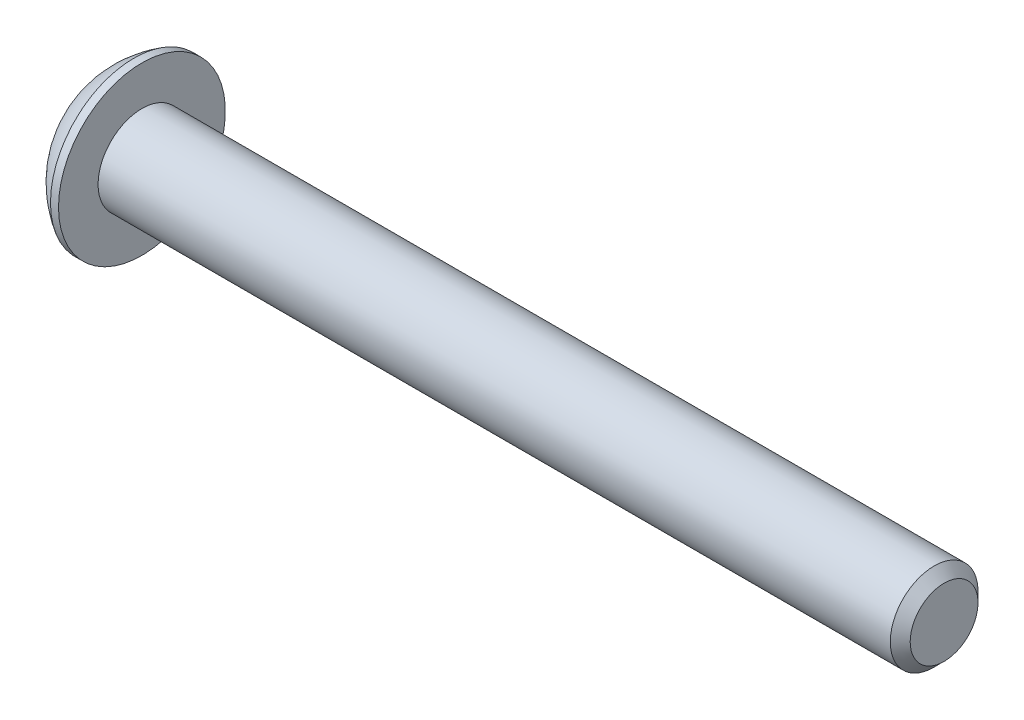
ISO-10303-21;
HEADER;
FILE_DESCRIPTION(('STEP AP214'),'2;1');
FILE_NAME('part.step','',(''),(''),'','','');
FILE_SCHEMA(('AUTOMOTIVE_DESIGN { 1 0 10303 214 1 1 1 1 }'));
ENDSEC;
DATA;
#1=APPLICATION_CONTEXT('core data for automotive mechanical design processes');
#2=APPLICATION_PROTOCOL_DEFINITION('international standard','automotive_design',2000,#1);
#3=PRODUCT_CONTEXT('',#1,'mechanical');
#4=PRODUCT('Part','Part','',(#3));
#5=PRODUCT_RELATED_PRODUCT_CATEGORY('part','',(#4));
#6=PRODUCT_DEFINITION_FORMATION('','',#4);
#7=PRODUCT_DEFINITION_CONTEXT('part definition',#1,'design');
#8=PRODUCT_DEFINITION('design','',#6,#7);
#9=PRODUCT_DEFINITION_SHAPE('','',#8);
#10=(LENGTH_UNIT() NAMED_UNIT(*) SI_UNIT(.MILLI.,.METRE.));
#11=(NAMED_UNIT(*) PLANE_ANGLE_UNIT() SI_UNIT($,.RADIAN.));
#12=(NAMED_UNIT(*) SI_UNIT($,.STERADIAN.) SOLID_ANGLE_UNIT());
#13=UNCERTAINTY_MEASURE_WITH_UNIT(LENGTH_MEASURE(1.E-05),#10,'distance_accuracy_value','');
#14=(GEOMETRIC_REPRESENTATION_CONTEXT(3) GLOBAL_UNCERTAINTY_ASSIGNED_CONTEXT((#13)) GLOBAL_UNIT_ASSIGNED_CONTEXT((#10,
#11,#12)) REPRESENTATION_CONTEXT('',''));
#15=CARTESIAN_POINT('',(0.,0.,0.));
#16=DIRECTION('',(0.,0.,1.));
#17=DIRECTION('',(1.,0.,0.));
#18=AXIS2_PLACEMENT_3D('',#15,#16,#17);
#19=CARTESIAN_POINT('',(1.32080000000034,0.,0.));
#20=DIRECTION('',(-1.,0.,0.));
#21=DIRECTION('',(0.,0.,1.));
#22=AXIS2_PLACEMENT_3D('',#19,#20,#21);
#23=CONICAL_SURFACE('',#22,1.1937999999998,1.04719755119608);
#24=CARTESIAN_POINT('',(2.01004075135902,0.,4.44089209850063E-13));
#25=VERTEX_POINT('',#24);
#26=VERTEX_LOOP('',#25);
#27=FACE_BOUND('',#26,.T.);
#28=CARTESIAN_POINT('',(1.32080000000009,0.,0.));
#29=DIRECTION('',(-1.,0.,0.));
#30=DIRECTION('',(0.,0.,1.));
#31=AXIS2_PLACEMENT_3D('',#28,#29,#30);
#32=CIRCLE('',#31,1.19380000000024);
#33=CARTESIAN_POINT('',(1.32080000000004,-1.03386112703797,0.59690000000006));
#34=VERTEX_POINT('',#33);
#35=CARTESIAN_POINT('',(1.32080000000004,0.,1.19380000000012));
#36=VERTEX_POINT('',#35);
#37=EDGE_CURVE('E19',#34,#36,#32,.T.);
#38=ORIENTED_EDGE('',*,*,#37,.T.);
#39=CARTESIAN_POINT('',(1.32080000000009,0.,0.));
#40=DIRECTION('',(-1.,0.,0.));
#41=DIRECTION('',(0.,0.,1.));
#42=AXIS2_PLACEMENT_3D('',#39,#40,#41);
#43=CIRCLE('',#42,1.19380000000024);
#44=CARTESIAN_POINT('',(1.32080000000004,1.03386112703797,0.596900000000061));
#45=VERTEX_POINT('',#44);
#46=EDGE_CURVE('E147',#36,#45,#43,.T.);
#47=ORIENTED_EDGE('',*,*,#46,.T.);
#48=CARTESIAN_POINT('',(1.32080000000009,0.,0.));
#49=DIRECTION('',(-1.,0.,0.));
#50=DIRECTION('',(0.,0.,1.));
#51=AXIS2_PLACEMENT_3D('',#48,#49,#50);
#52=CIRCLE('',#51,1.19380000000024);
#53=CARTESIAN_POINT('',(1.32080000000004,1.03386112703797,-0.596900000000061));
#54=VERTEX_POINT('',#53);
#55=EDGE_CURVE('E402',#45,#54,#52,.T.);
#56=ORIENTED_EDGE('',*,*,#55,.T.);
#57=CARTESIAN_POINT('',(1.32080000000009,0.,0.));
#58=DIRECTION('',(-1.,0.,0.));
#59=DIRECTION('',(0.,0.,1.));
#60=AXIS2_PLACEMENT_3D('',#57,#58,#59);
#61=CIRCLE('',#60,1.19380000000024);
#62=CARTESIAN_POINT('',(1.32080000000004,1.49457637585666E-12,-1.19380000000012));
#63=VERTEX_POINT('',#62);
#64=EDGE_CURVE('E403',#54,#63,#61,.T.);
#65=ORIENTED_EDGE('',*,*,#64,.T.);
#66=CARTESIAN_POINT('',(1.32080000000009,0.,0.));
#67=DIRECTION('',(-1.,0.,0.));
#68=DIRECTION('',(0.,0.,1.));
#69=AXIS2_PLACEMENT_3D('',#66,#67,#68);
#70=CIRCLE('',#69,1.19380000000024);
#71=CARTESIAN_POINT('',(1.32080000000004,-1.03386112703797,-0.59690000000006));
#72=VERTEX_POINT('',#71);
#73=EDGE_CURVE('E92',#63,#72,#70,.T.);
#74=ORIENTED_EDGE('',*,*,#73,.T.);
#75=CARTESIAN_POINT('',(1.32080000000009,0.,0.));
#76=DIRECTION('',(-1.,0.,0.));
#77=DIRECTION('',(0.,0.,1.));
#78=AXIS2_PLACEMENT_3D('',#75,#76,#77);
#79=CIRCLE('',#78,1.19380000000024);
#80=EDGE_CURVE('E88',#72,#34,#79,.T.);
#81=ORIENTED_EDGE('',*,*,#80,.T.);
#82=EDGE_LOOP('',(#38,#47,#56,#65,#74,#81));
#83=FACE_BOUND('',#82,.T.);
#84=ADVANCED_FACE('F16',(#27,#83),#23,.F.);
#85=CARTESIAN_POINT('',(1.3208,-2.06772225407572,-1.1938));
#86=DIRECTION('',(1.,0.,0.));
#87=DIRECTION('',(0.,0.,-1.));
#88=AXIS2_PLACEMENT_3D('',#85,#86,#87);
#89=PLANE('',#88);
#90=DIRECTION('',(0.,0.5,0.866025403784439));
#91=VECTOR('',#90,1.);
#92=CARTESIAN_POINT('',(1.3208,-1.37848150271715,0.));
#93=LINE('',#92,#91);
#94=CARTESIAN_POINT('',(1.3208,-0.689240751358574,1.1938));
#95=VERTEX_POINT('',#94);
#96=EDGE_CURVE('E100',#95,#34,#93,.F.);
#97=ORIENTED_EDGE('',*,*,#96,.F.);
#98=DIRECTION('',(0.,1.,0.));
#99=VECTOR('',#98,1.);
#100=CARTESIAN_POINT('',(1.3208,-0.689240751358574,1.1938));
#101=LINE('',#100,#99);
#102=EDGE_CURVE('E102',#36,#95,#101,.F.);
#103=ORIENTED_EDGE('',*,*,#102,.F.);
#104=ORIENTED_EDGE('',*,*,#37,.F.);
#105=EDGE_LOOP('',(#97,#103,#104));
#106=FACE_BOUND('',#105,.T.);
#107=ADVANCED_FACE('F98',(#106),#89,.F.);
#108=CARTESIAN_POINT('',(1.3208,-2.06772225407572,-1.1938));
#109=DIRECTION('',(1.,0.,0.));
#110=DIRECTION('',(0.,0.,-1.));
#111=AXIS2_PLACEMENT_3D('',#108,#109,#110);
#112=PLANE('',#111);
#113=DIRECTION('',(0.,-0.5,0.866025403784439));
#114=VECTOR('',#113,1.);
#115=CARTESIAN_POINT('',(1.3208,-0.689240751358574,-1.1938));
#116=LINE('',#115,#114);
#117=CARTESIAN_POINT('',(1.3208,-1.37848150271715,0.));
#118=VERTEX_POINT('',#117);
#119=EDGE_CURVE('E108',#118,#72,#116,.F.);
#120=ORIENTED_EDGE('',*,*,#119,.F.);
#121=DIRECTION('',(0.,0.5,0.866025403784439));
#122=VECTOR('',#121,1.);
#123=CARTESIAN_POINT('',(1.3208,-1.37848150271715,0.));
#124=LINE('',#123,#122);
#125=EDGE_CURVE('E105',#34,#118,#124,.F.);
#126=ORIENTED_EDGE('',*,*,#125,.F.);
#127=ORIENTED_EDGE('',*,*,#80,.F.);
#128=EDGE_LOOP('',(#120,#126,#127));
#129=FACE_BOUND('',#128,.T.);
#130=ADVANCED_FACE('F106',(#129),#112,.F.);
#131=CARTESIAN_POINT('',(1.3208,-2.06772225407572,-1.1938));
#132=DIRECTION('',(1.,0.,0.));
#133=DIRECTION('',(0.,0.,-1.));
#134=AXIS2_PLACEMENT_3D('',#131,#132,#133);
#135=PLANE('',#134);
#136=DIRECTION('',(0.,1.,0.));
#137=VECTOR('',#136,1.);
#138=CARTESIAN_POINT('',(1.3208,0.689240751358577,-1.1938));
#139=LINE('',#138,#137);
#140=CARTESIAN_POINT('',(1.3208,-0.689240751358574,-1.1938));
#141=VERTEX_POINT('',#140);
#142=EDGE_CURVE('E373',#141,#63,#139,.T.);
#143=ORIENTED_EDGE('',*,*,#142,.F.);
#144=DIRECTION('',(0.,-0.5,0.866025403784439));
#145=VECTOR('',#144,1.);
#146=CARTESIAN_POINT('',(1.3208,-0.689240751358574,-1.1938));
#147=LINE('',#146,#145);
#148=EDGE_CURVE('E385',#72,#141,#147,.F.);
#149=ORIENTED_EDGE('',*,*,#148,.F.);
#150=ORIENTED_EDGE('',*,*,#73,.F.);
#151=EDGE_LOOP('',(#143,#149,#150));
#152=FACE_BOUND('',#151,.T.);
#153=ADVANCED_FACE('F190',(#152),#135,.F.);
#154=CARTESIAN_POINT('',(1.3208,-2.06772225407572,-1.1938));
#155=DIRECTION('',(1.,0.,0.));
#156=DIRECTION('',(0.,0.,-1.));
#157=AXIS2_PLACEMENT_3D('',#154,#155,#156);
#158=PLANE('',#157);
#159=DIRECTION('',(0.,-0.5,-0.866025403784439));
#160=VECTOR('',#159,1.);
#161=CARTESIAN_POINT('',(1.3208,1.37848150271715,0.));
#162=LINE('',#161,#160);
#163=CARTESIAN_POINT('',(1.3208,0.689240751358577,-1.1938));
#164=VERTEX_POINT('',#163);
#165=EDGE_CURVE('E359',#164,#54,#162,.F.);
#166=ORIENTED_EDGE('',*,*,#165,.F.);
#167=DIRECTION('',(0.,1.,0.));
#168=VECTOR('',#167,1.);
#169=CARTESIAN_POINT('',(1.3208,0.689240751358577,-1.1938));
#170=LINE('',#169,#168);
#171=EDGE_CURVE('E370',#63,#164,#170,.T.);
#172=ORIENTED_EDGE('',*,*,#171,.F.);
#173=ORIENTED_EDGE('',*,*,#64,.F.);
#174=EDGE_LOOP('',(#166,#172,#173));
#175=FACE_BOUND('',#174,.T.);
#176=ADVANCED_FACE('F186',(#175),#158,.F.);
#177=CARTESIAN_POINT('',(1.3208,-2.06772225407572,-1.1938));
#178=DIRECTION('',(1.,0.,0.));
#179=DIRECTION('',(0.,0.,-1.));
#180=AXIS2_PLACEMENT_3D('',#177,#178,#179);
#181=PLANE('',#180);
#182=DIRECTION('',(0.,0.5,-0.866025403784439));
#183=VECTOR('',#182,1.);
#184=CARTESIAN_POINT('',(1.3208,0.689240751358576,1.1938));
#185=LINE('',#184,#183);
#186=CARTESIAN_POINT('',(1.3208,1.37848150271715,0.));
#187=VERTEX_POINT('',#186);
#188=EDGE_CURVE('E338',#187,#45,#185,.F.);
#189=ORIENTED_EDGE('',*,*,#188,.F.);
#190=DIRECTION('',(0.,-0.5,-0.866025403784439));
#191=VECTOR('',#190,1.);
#192=CARTESIAN_POINT('',(1.3208,1.37848150271715,0.));
#193=LINE('',#192,#191);
#194=EDGE_CURVE('E357',#54,#187,#193,.F.);
#195=ORIENTED_EDGE('',*,*,#194,.F.);
#196=ORIENTED_EDGE('',*,*,#55,.F.);
#197=EDGE_LOOP('',(#189,#195,#196));
#198=FACE_BOUND('',#197,.T.);
#199=ADVANCED_FACE('F182',(#198),#181,.F.);
#200=CARTESIAN_POINT('',(1.3208,-2.06772225407572,-1.1938));
#201=DIRECTION('',(1.,0.,0.));
#202=DIRECTION('',(0.,0.,-1.));
#203=AXIS2_PLACEMENT_3D('',#200,#201,#202);
#204=PLANE('',#203);
#205=DIRECTION('',(0.,1.,0.));
#206=VECTOR('',#205,1.);
#207=CARTESIAN_POINT('',(1.3208,-0.689240751358574,1.1938));
#208=LINE('',#207,#206);
#209=CARTESIAN_POINT('',(1.3208,0.689240751358576,1.1938));
#210=VERTEX_POINT('',#209);
#211=EDGE_CURVE('E117',#210,#36,#208,.F.);
#212=ORIENTED_EDGE('',*,*,#211,.F.);
#213=DIRECTION('',(0.,0.5,-0.866025403784439));
#214=VECTOR('',#213,1.);
#215=CARTESIAN_POINT('',(1.3208,0.689240751358576,1.1938));
#216=LINE('',#215,#214);
#217=EDGE_CURVE('E341',#45,#210,#216,.F.);
#218=ORIENTED_EDGE('',*,*,#217,.F.);
#219=ORIENTED_EDGE('',*,*,#46,.F.);
#220=EDGE_LOOP('',(#212,#218,#219));
#221=FACE_BOUND('',#220,.T.);
#222=ADVANCED_FACE('F178',(#221),#204,.F.);
#223=CARTESIAN_POINT('',(1.3208,-0.689240751358574,1.1938));
#224=DIRECTION('',(0.,0.,-1.));
#225=DIRECTION('',(0.,1.,0.));
#226=AXIS2_PLACEMENT_3D('',#223,#224,#225);
#227=PLANE('',#226);
#228=DIRECTION('',(0.,1.,0.));
#229=VECTOR('',#228,1.);
#230=CARTESIAN_POINT('',(0.,0.,1.1938));
#231=LINE('',#230,#229);
#232=CARTESIAN_POINT('',(0.,0.689240751358577,1.1938));
#233=VERTEX_POINT('',#232);
#234=CARTESIAN_POINT('',(0.,-0.689240751358574,1.1938));
#235=VERTEX_POINT('',#234);
#236=EDGE_CURVE('E335',#233,#235,#231,.F.);
#237=ORIENTED_EDGE('',*,*,#236,.F.);
#238=DIRECTION('',(1.,0.,0.));
#239=VECTOR('',#238,1.);
#240=CARTESIAN_POINT('',(1.3208,0.689240751358576,1.1938));
#241=LINE('',#240,#239);
#242=EDGE_CURVE('E347',#210,#233,#241,.F.);
#243=ORIENTED_EDGE('',*,*,#242,.F.);
#244=ORIENTED_EDGE('',*,*,#211,.T.);
#245=ORIENTED_EDGE('',*,*,#102,.T.);
#246=DIRECTION('',(1.,0.,0.));
#247=VECTOR('',#246,1.);
#248=CARTESIAN_POINT('',(1.3208,-0.689240751358574,1.1938));
#249=LINE('',#248,#247);
#250=EDGE_CURVE('E111',#235,#95,#249,.T.);
#251=ORIENTED_EDGE('',*,*,#250,.F.);
#252=EDGE_LOOP('',(#237,#243,#244,#245,#251));
#253=FACE_BOUND('',#252,.T.);
#254=ADVANCED_FACE('F175',(#253),#227,.T.);
#255=CARTESIAN_POINT('',(1.3208,-1.37848150271715,0.));
#256=DIRECTION('',(0.,0.866025403784439,-0.5));
#257=DIRECTION('',(0.,0.5,0.866025403784439));
#258=AXIS2_PLACEMENT_3D('',#255,#256,#257);
#259=PLANE('',#258);
#260=DIRECTION('',(0.,-0.5,-0.866025403784439));
#261=VECTOR('',#260,1.);
#262=CARTESIAN_POINT('',(0.,-0.689240751358574,1.1938));
#263=LINE('',#262,#261);
#264=CARTESIAN_POINT('',(0.,-1.37848150271715,0.));
#265=VERTEX_POINT('',#264);
#266=EDGE_CURVE('E332',#235,#265,#263,.T.);
#267=ORIENTED_EDGE('',*,*,#266,.F.);
#268=ORIENTED_EDGE('',*,*,#250,.T.);
#269=ORIENTED_EDGE('',*,*,#96,.T.);
#270=ORIENTED_EDGE('',*,*,#125,.T.);
#271=DIRECTION('',(1.,0.,0.));
#272=VECTOR('',#271,1.);
#273=CARTESIAN_POINT('',(1.3208,-1.37848150271715,0.));
#274=LINE('',#273,#272);
#275=EDGE_CURVE('E382',#265,#118,#274,.T.);
#276=ORIENTED_EDGE('',*,*,#275,.F.);
#277=EDGE_LOOP('',(#267,#268,#269,#270,#276));
#278=FACE_BOUND('',#277,.T.);
#279=ADVANCED_FACE('F115',(#278),#259,.T.);
#280=CARTESIAN_POINT('',(1.3208,-0.689240751358574,-1.1938));
#281=DIRECTION('',(0.,0.866025403784439,0.5));
#282=DIRECTION('',(0.,-0.5,0.866025403784439));
#283=AXIS2_PLACEMENT_3D('',#280,#281,#282);
#284=PLANE('',#283);
#285=DIRECTION('',(0.,0.5,-0.866025403784439));
#286=VECTOR('',#285,1.);
#287=CARTESIAN_POINT('',(0.,-1.37848150271715,0.));
#288=LINE('',#287,#286);
#289=CARTESIAN_POINT('',(0.,-0.689240751358574,-1.1938));
#290=VERTEX_POINT('',#289);
#291=EDGE_CURVE('E329',#265,#290,#288,.T.);
#292=ORIENTED_EDGE('',*,*,#291,.F.);
#293=ORIENTED_EDGE('',*,*,#275,.T.);
#294=ORIENTED_EDGE('',*,*,#119,.T.);
#295=ORIENTED_EDGE('',*,*,#148,.T.);
#296=DIRECTION('',(1.,0.,0.));
#297=VECTOR('',#296,1.);
#298=CARTESIAN_POINT('',(1.3208,-0.689240751358574,-1.1938));
#299=LINE('',#298,#297);
#300=EDGE_CURVE('E367',#290,#141,#299,.T.);
#301=ORIENTED_EDGE('',*,*,#300,.F.);
#302=EDGE_LOOP('',(#292,#293,#294,#295,#301));
#303=FACE_BOUND('',#302,.T.);
#304=ADVANCED_FACE('F168',(#303),#284,.T.);
#305=CARTESIAN_POINT('',(1.3208,0.689240751358577,-1.1938));
#306=DIRECTION('',(0.,0.,1.));
#307=DIRECTION('',(1.,0.,0.));
#308=AXIS2_PLACEMENT_3D('',#305,#306,#307);
#309=PLANE('',#308);
#310=DIRECTION('',(0.,1.,0.));
#311=VECTOR('',#310,1.);
#312=CARTESIAN_POINT('',(0.,0.,-1.1938));
#313=LINE('',#312,#311);
#314=CARTESIAN_POINT('',(0.,0.689240751358577,-1.1938));
#315=VERTEX_POINT('',#314);
#316=EDGE_CURVE('E326',#290,#315,#313,.T.);
#317=ORIENTED_EDGE('',*,*,#316,.F.);
#318=ORIENTED_EDGE('',*,*,#300,.T.);
#319=ORIENTED_EDGE('',*,*,#142,.T.);
#320=ORIENTED_EDGE('',*,*,#171,.T.);
#321=DIRECTION('',(1.,0.,0.));
#322=VECTOR('',#321,1.);
#323=CARTESIAN_POINT('',(1.3208,0.689240751358577,-1.1938));
#324=LINE('',#323,#322);
#325=EDGE_CURVE('E342',#315,#164,#324,.T.);
#326=ORIENTED_EDGE('',*,*,#325,.F.);
#327=EDGE_LOOP('',(#317,#318,#319,#320,#326));
#328=FACE_BOUND('',#327,.T.);
#329=ADVANCED_FACE('F165',(#328),#309,.T.);
#330=CARTESIAN_POINT('',(1.3208,1.37848150271715,0.));
#331=DIRECTION('',(0.,-0.866025403784439,0.5));
#332=DIRECTION('',(0.,-0.5,-0.866025403784439));
#333=AXIS2_PLACEMENT_3D('',#330,#331,#332);
#334=PLANE('',#333);
#335=DIRECTION('',(0.,0.5,0.866025403784439));
#336=VECTOR('',#335,1.);
#337=CARTESIAN_POINT('',(0.,0.689240751358577,-1.1938));
#338=LINE('',#337,#336);
#339=CARTESIAN_POINT('',(0.,1.37848150271715,0.));
#340=VERTEX_POINT('',#339);
#341=EDGE_CURVE('E323',#315,#340,#338,.T.);
#342=ORIENTED_EDGE('',*,*,#341,.F.);
#343=ORIENTED_EDGE('',*,*,#325,.T.);
#344=ORIENTED_EDGE('',*,*,#165,.T.);
#345=ORIENTED_EDGE('',*,*,#194,.T.);
#346=DIRECTION('',(1.,0.,0.));
#347=VECTOR('',#346,1.);
#348=CARTESIAN_POINT('',(1.3208,1.37848150271715,0.));
#349=LINE('',#348,#347);
#350=EDGE_CURVE('E34',#340,#187,#349,.T.);
#351=ORIENTED_EDGE('',*,*,#350,.F.);
#352=EDGE_LOOP('',(#342,#343,#344,#345,#351));
#353=FACE_BOUND('',#352,.T.);
#354=ADVANCED_FACE('F161',(#353),#334,.T.);
#355=CARTESIAN_POINT('',(1.3208,0.689240751358576,1.1938));
#356=DIRECTION('',(0.,-0.866025403784439,-0.5));
#357=DIRECTION('',(0.,0.5,-0.866025403784439));
#358=AXIS2_PLACEMENT_3D('',#355,#356,#357);
#359=PLANE('',#358);
#360=DIRECTION('',(0.,-0.5,0.866025403784439));
#361=VECTOR('',#360,1.);
#362=CARTESIAN_POINT('',(0.,1.37848150271715,0.));
#363=LINE('',#362,#361);
#364=EDGE_CURVE('E146',#340,#233,#363,.T.);
#365=ORIENTED_EDGE('',*,*,#364,.F.);
#366=ORIENTED_EDGE('',*,*,#350,.T.);
#367=ORIENTED_EDGE('',*,*,#188,.T.);
#368=ORIENTED_EDGE('',*,*,#217,.T.);
#369=ORIENTED_EDGE('',*,*,#242,.T.);
#370=EDGE_LOOP('',(#365,#366,#367,#368,#369));
#371=FACE_BOUND('',#370,.T.);
#372=ADVANCED_FACE('F157',(#371),#359,.T.);
#373=CARTESIAN_POINT('',(0.,0.,0.));
#374=DIRECTION('',(-1.,0.,0.));
#375=DIRECTION('',(0.,0.,1.));
#376=AXIS2_PLACEMENT_3D('',#373,#374,#375);
#377=PLANE('',#376);
#378=ORIENTED_EDGE('',*,*,#341,.T.);
#379=ORIENTED_EDGE('',*,*,#364,.T.);
#380=ORIENTED_EDGE('',*,*,#236,.T.);
#381=ORIENTED_EDGE('',*,*,#266,.T.);
#382=ORIENTED_EDGE('',*,*,#291,.T.);
#383=ORIENTED_EDGE('',*,*,#316,.T.);
#384=EDGE_LOOP('',(#378,#379,#380,#381,#382,#383));
#385=FACE_BOUND('',#384,.T.);
#386=CARTESIAN_POINT('',(0.,1.9812,0.));
#387=CARTESIAN_POINT('',(0.,1.9811996664299,0.0556258831179428));
#388=CARTESIAN_POINT('',(0.,1.97885520380442,0.111261989398606));
#389=CARTESIAN_POINT('',(0.,1.96949260169541,0.222149719830458));
#390=CARTESIAN_POINT('',(0.,1.96247308239605,0.277401225602895));
#391=CARTESIAN_POINT('',(0.,1.94379192841038,0.387209508139747));
#392=CARTESIAN_POINT('',(-1.85325793235264E-13,1.93212292489526,0.441765039546365));
#393=CARTESIAN_POINT('',(1.86344214223505E-13,1.90422331175315,0.549729449347493));
#394=CARTESIAN_POINT('',(6.94543371897454E-13,1.88798900035338,0.603137359208869));
#395=CARTESIAN_POINT('',(1.15501975216981E-12,1.83266214476501,0.760839131321828));
#396=CARTESIAN_POINT('',(0.,1.78690023648845,0.862876433575429));
#397=CARTESIAN_POINT('',(0.,1.67887358150667,1.05780719540872));
#398=CARTESIAN_POINT('',(9.54193214892627E-13,1.6166082074585,1.15070030720801));
#399=CARTESIAN_POINT('',(5.94805591894675E-13,1.51224157140982,1.28116890915697));
#400=CARTESIAN_POINT('',(1.63221293851378E-13,1.4755970394354,1.32320451127026));
#401=CARTESIAN_POINT('',(-1.62196980336157E-13,1.39893832619713,1.40400288695709));
#402=CARTESIAN_POINT('',(0.,1.35892742784698,1.44276877695455));
#403=CARTESIAN_POINT('',(1.14362537325405E-13,1.23416504602197,1.55382272417904));
#404=CARTESIAN_POINT('',(0.,1.14466125559859,1.62089527952111));
#405=CARTESIAN_POINT('',(0.,0.955712144178167,1.7390221808118));
#406=CARTESIAN_POINT('',(0.,0.856267198233564,1.79007713076007));
#407=CARTESIAN_POINT('',(0.,0.650206345910843,1.87477637530954));
#408=CARTESIAN_POINT('',(0.,0.543590516134855,1.90842085586267));
#409=CARTESIAN_POINT('',(0.,0.326226155292018,1.95733039300656));
#410=CARTESIAN_POINT('',(0.,0.21547760215793,1.97259535144288));
#411=CARTESIAN_POINT('',(0.,-0.00701040587544639,1.98431697865418));
#412=CARTESIAN_POINT('',(0.,-0.118749860774734,1.98077364742917));
#413=CARTESIAN_POINT('',(0.,-0.340050178355485,1.95497485623825));
#414=CARTESIAN_POINT('',(0.,-0.449611052668255,1.93271949620218));
#415=CARTESIAN_POINT('',(0.,-0.663431110729174,1.87014138774523));
#416=CARTESIAN_POINT('',(0.,-0.76769023783852,1.82981844635272));
#417=CARTESIAN_POINT('',(0.,-0.968005760719347,1.73219968377096));
#418=CARTESIAN_POINT('',(0.,-1.0640618469811,1.6749032225164));
#419=CARTESIAN_POINT('',(0.,-1.19980276751283,1.57757371205873));
#420=CARTESIAN_POINT('',(0.,-1.24366557129213,1.54322665019466));
#421=CARTESIAN_POINT('',(0.,-1.32838995706696,1.47093063174264));
#422=CARTESIAN_POINT('',(0.,-1.36924860178706,1.43297823102439));
#423=CARTESIAN_POINT('',(0.,-1.48674671849223,1.31419842051173));
#424=CARTESIAN_POINT('',(0.,-1.55842832343237,1.22836221289311));
#425=CARTESIAN_POINT('',(0.,-1.6863396856475,1.04586168272493));
#426=CARTESIAN_POINT('',(0.,-1.7425700302488,0.949197771949774));
#427=CARTESIAN_POINT('',(0.,-1.8141614250401,0.798182600298684));
#428=CARTESIAN_POINT('',(0.,-1.83591780585875,0.746776203847791));
#429=CARTESIAN_POINT('',(0.,-1.87500754181092,0.642341081688636));
#430=CARTESIAN_POINT('',(0.,-1.89234447645404,0.589313708122847));
#431=CARTESIAN_POINT('',(0.,-1.92246053433554,0.482076273028395));
#432=CARTESIAN_POINT('',(0.,-1.93524685475118,0.42786822425751));
#433=CARTESIAN_POINT('',(0.,-1.95620937250494,0.318578151844611));
#434=CARTESIAN_POINT('',(0.,-1.96438692958147,0.263496390912872));
#435=CARTESIAN_POINT('',(0.,-1.97388528284653,0.173607715038558));
#436=CARTESIAN_POINT('',(0.,-1.97662743364426,0.138944718024998));
#437=CARTESIAN_POINT('',(0.,-1.98028489645283,0.0695224782567002));
#438=CARTESIAN_POINT('',(0.,-1.98120020846367,0.0347632355019631));
#439=CARTESIAN_POINT('',(0.,-1.9811996664299,-0.0556258831179437));
#440=CARTESIAN_POINT('',(0.,-1.97885520380442,-0.111261989398607));
#441=CARTESIAN_POINT('',(0.,-1.96949260169541,-0.222149719830459));
#442=CARTESIAN_POINT('',(0.,-1.96247308239605,-0.277401225602897));
#443=CARTESIAN_POINT('',(0.,-1.94379192841039,-0.387209508139749));
#444=CARTESIAN_POINT('',(-1.85269749640691E-13,-1.93212292489526,-0.441765039546367));
#445=CARTESIAN_POINT('',(1.86288125054388E-13,-1.90422331175315,-0.549729449347495));
#446=CARTESIAN_POINT('',(6.94525090263764E-13,-1.88798900035338,-0.603137359208872));
#447=CARTESIAN_POINT('',(1.15505622829081E-12,-1.83266214476501,-0.760839131321831));
#448=CARTESIAN_POINT('',(0.,-1.78690023648845,-0.862876433575431));
#449=CARTESIAN_POINT('',(0.,-1.67887358150667,-1.05780719540872));
#450=CARTESIAN_POINT('',(9.54248812869379E-13,-1.6166082074585,-1.15070030720801));
#451=CARTESIAN_POINT('',(5.94777756479239E-13,-1.51224157140982,-1.28116890915698));
#452=CARTESIAN_POINT('',(1.63138949183833E-13,-1.47559703943539,-1.32320451127027));
#453=CARTESIAN_POINT('',(-1.62114715061273E-13,-1.39893832619713,-1.40400288695709));
#454=CARTESIAN_POINT('',(0.,-1.35892742784699,-1.44276877695455));
#455=CARTESIAN_POINT('',(1.13760489124207E-13,-1.23416504602197,-1.55382272417904));
#456=CARTESIAN_POINT('',(0.,-1.14466125559859,-1.62089527952111));
#457=CARTESIAN_POINT('',(0.,-0.95571214417816,-1.73902218081179));
#458=CARTESIAN_POINT('',(0.,-0.856267198233559,-1.79007713076007));
#459=CARTESIAN_POINT('',(0.,-0.650206345910841,-1.87477637530954));
#460=CARTESIAN_POINT('',(0.,-0.543590516134854,-1.90842085586267));
#461=CARTESIAN_POINT('',(0.,-0.326226155292018,-1.95733039300657));
#462=CARTESIAN_POINT('',(0.,-0.215477602157929,-1.97259535144288));
#463=CARTESIAN_POINT('',(0.,0.0070104058754487,-1.98431697865418));
#464=CARTESIAN_POINT('',(0.,0.118749860774737,-1.98077364742916));
#465=CARTESIAN_POINT('',(0.,0.340050178355489,-1.95497485623824));
#466=CARTESIAN_POINT('',(0.,0.44961105266826,-1.93271949620218));
#467=CARTESIAN_POINT('',(0.,0.663431110729178,-1.87014138774524));
#468=CARTESIAN_POINT('',(0.,0.767690237838524,-1.82981844635272));
#469=CARTESIAN_POINT('',(0.,0.968005760719348,-1.73219968377096));
#470=CARTESIAN_POINT('',(0.,1.0640618469811,-1.67490322251639));
#471=CARTESIAN_POINT('',(0.,1.19980276751283,-1.57757371205873));
#472=CARTESIAN_POINT('',(0.,1.24366557129214,-1.54322665019465));
#473=CARTESIAN_POINT('',(0.,1.32838995706696,-1.47093063174263));
#474=CARTESIAN_POINT('',(0.,1.36924860178706,-1.43297823102439));
#475=CARTESIAN_POINT('',(0.,1.48674671849223,-1.31419842051172));
#476=CARTESIAN_POINT('',(0.,1.55842832343237,-1.22836221289311));
#477=CARTESIAN_POINT('',(0.,1.6863396856475,-1.04586168272492));
#478=CARTESIAN_POINT('',(0.,1.7425700302488,-0.949197771949768));
#479=CARTESIAN_POINT('',(0.,1.8141614250401,-0.798182600298677));
#480=CARTESIAN_POINT('',(0.,1.83591780585875,-0.746776203847785));
#481=CARTESIAN_POINT('',(0.,1.87500754181092,-0.64234108168863));
#482=CARTESIAN_POINT('',(0.,1.89234447645404,-0.589313708122841));
#483=CARTESIAN_POINT('',(0.,1.92246053433555,-0.482076273028389));
#484=CARTESIAN_POINT('',(0.,1.93524685475118,-0.427868224257505));
#485=CARTESIAN_POINT('',(0.,1.95620937250494,-0.318578151844605));
#486=CARTESIAN_POINT('',(0.,1.96438692958147,-0.263496390912866));
#487=CARTESIAN_POINT('',(0.,1.97388528284653,-0.173607715038553));
#488=CARTESIAN_POINT('',(0.,1.97662743364426,-0.138944718024994));
#489=CARTESIAN_POINT('',(0.,1.98028489645283,-0.0695224782566989));
#490=CARTESIAN_POINT('',(0.,1.98120020846367,-0.034763235501963));
#491=CARTESIAN_POINT('',(0.,1.9812,0.));
#492=B_SPLINE_CURVE_WITH_KNOTS('',3,(#386,#387,#388,#389,#390,#391,#392,#393,#394,#395,#396,
#397,#398,#399,#400,#401,#402,#403,#404,#405,#406,#407,#408,#409,#410,#411,#412,#413,#414,#415,
#416,#417,#418,#419,#420,#421,#422,#423,#424,#425,#426,#427,#428,#429,#430,#431,#432,#433,#434,
#435,#436,#437,#438,#439,#440,#441,#442,#443,#444,#445,#446,#447,#448,#449,#450,#451,#452,#453,
#454,#455,#456,#457,#458,#459,#460,#461,#462,#463,#464,#465,#466,#467,#468,#469,#470,#471,#472,
#473,#474,#475,#476,#477,#478,#479,#480,#481,#482,#483,#484,#485,#486,#487,#488,#489,#490,#491),
.UNSPECIFIED.,.T.,.F.,(4,2,2,2,2,2,2,2,2,2,2,2,2,2,2,2,2,2,2,2,2,2,2,2,2,2,2,2,2,2,2,2,2,2,2,2,
2,2,2,2,2,2,2,2,2,2,2,2,2,2,2,2,4),(0.,0.166845646007828,0.333740557374255,0.500901034367693,
0.668197445942386,1.00199278686282,1.33580081809885,1.50292354032982,1.6698851310853,
2.00370118900129,2.33750465770544,2.67130456115909,3.005106247238,3.33890793331696,
3.67270783677065,4.00651130547476,4.34032736339026,4.50728895414554,4.67441167637632,
5.00821970761259,5.34201504853332,5.50931146010827,5.67647193710191,5.84336684846844,
6.0102124944764,6.11448220058334,6.21875190669029,6.38559755269812,6.55249246406454,
6.71965294105798,6.88694935263268,7.22074469355311,7.55455272478915,7.72167544702011,
7.88863703777559,8.22245309569158,8.55625656439573,8.89005646784938,9.2238581539283,
9.55765984000725,9.89145974346094,10.2252632121651,10.5590792700806,10.7260408608358,
10.8931635830666,11.2269716143029,11.5607669552236,11.7280633667986,11.8952238437922,
12.0621187551587,12.2289644011667,12.3332341072736,12.4375038133806),.UNSPECIFIED.);
#493=CARTESIAN_POINT('',(0.,1.9812,0.));
#494=VERTEX_POINT('',#493);
#495=EDGE_CURVE('E139',#494,#494,#492,.T.);
#496=ORIENTED_EDGE('',*,*,#495,.F.);
#497=EDGE_LOOP('',(#496));
#498=FACE_BOUND('',#497,.T.);
#499=ADVANCED_FACE('F153',(#385,#498),#377,.T.);
#500=CARTESIAN_POINT('',(4.13385,0.,0.));
#501=DIRECTION('',(0.,1.,0.));
#502=DIRECTION('',(1.,0.,0.));
#503=AXIS2_PLACEMENT_3D('',#500,#501,#502);
#504=SPHERICAL_SURFACE('',#503,4.58408870578439);
#505=CARTESIAN_POINT('',(1.8288,0.,0.));
#506=DIRECTION('',(-1.,0.,0.));
#507=DIRECTION('',(0.,0.,1.));
#508=AXIS2_PLACEMENT_3D('',#505,#506,#507);
#509=CIRCLE('',#508,3.9624);
#510=CARTESIAN_POINT('',(1.8288,0.,3.9624));
#511=VERTEX_POINT('',#510);
#512=EDGE_CURVE('E136',#511,#511,#509,.F.);
#513=ORIENTED_EDGE('',*,*,#512,.F.);
#514=EDGE_LOOP('',(#513));
#515=FACE_BOUND('',#514,.T.);
#516=ORIENTED_EDGE('',*,*,#495,.T.);
#517=EDGE_LOOP('',(#516));
#518=FACE_BOUND('',#517,.T.);
#519=ADVANCED_FACE('F149',(#515,#518),#504,.T.);
#520=CARTESIAN_POINT('',(40.3098,0.,0.));
#521=DIRECTION('',(-1.,0.,0.));
#522=DIRECTION('',(0.,0.,1.));
#523=AXIS2_PLACEMENT_3D('',#520,#521,#522);
#524=PLANE('',#523);
#525=CARTESIAN_POINT('',(40.3097999999886,0.,0.));
#526=DIRECTION('',(-1.,0.,0.));
#527=DIRECTION('',(0.,0.,1.));
#528=AXIS2_PLACEMENT_3D('',#525,#526,#527);
#529=CIRCLE('',#528,1.61036000002923);
#530=CARTESIAN_POINT('',(40.3097999999886,0.,1.61036000002923));
#531=VERTEX_POINT('',#530);
#532=EDGE_CURVE('E133',#531,#531,#529,.T.);
#533=ORIENTED_EDGE('',*,*,#532,.F.);
#534=EDGE_LOOP('',(#533));
#535=FACE_BOUND('',#534,.T.);
#536=ADVANCED_FACE('F220',(#535),#524,.F.);
#537=CARTESIAN_POINT('',(0.,0.,0.));
#538=DIRECTION('',(-1.,0.,0.));
#539=DIRECTION('',(0.,0.,1.));
#540=AXIS2_PLACEMENT_3D('',#537,#538,#539);
#541=CYLINDRICAL_SURFACE('',#540,3.9624);
#542=ORIENTED_EDGE('',*,*,#512,.T.);
#543=EDGE_LOOP('',(#542));
#544=FACE_BOUND('',#543,.T.);
#545=CARTESIAN_POINT('',(2.2098,0.,0.));
#546=DIRECTION('',(-1.,0.,0.));
#547=DIRECTION('',(0.,0.,1.));
#548=AXIS2_PLACEMENT_3D('',#545,#546,#547);
#549=CIRCLE('',#548,3.9624);
#550=CARTESIAN_POINT('',(2.2098,0.,3.9624));
#551=VERTEX_POINT('',#550);
#552=EDGE_CURVE('E130',#551,#551,#549,.T.);
#553=ORIENTED_EDGE('',*,*,#552,.T.);
#554=EDGE_LOOP('',(#553));
#555=FACE_BOUND('',#554,.T.);
#556=ADVANCED_FACE('F217',(#544,#555),#541,.T.);
#557=CARTESIAN_POINT('',(39.8373600000923,0.,0.));
#558=DIRECTION('',(-1.,0.,0.));
#559=DIRECTION('',(0.,0.,1.));
#560=AXIS2_PLACEMENT_3D('',#557,#558,#559);
#561=CONICAL_SURFACE('',#560,2.08279999992556,0.785398163397448);
#562=CARTESIAN_POINT('',(39.83736,0.,0.));
#563=DIRECTION('',(-1.,0.,0.));
#564=DIRECTION('',(0.,0.,1.));
#565=AXIS2_PLACEMENT_3D('',#562,#563,#564);
#566=CIRCLE('',#565,2.0828);
#567=CARTESIAN_POINT('',(39.83736,0.,2.0828));
#568=VERTEX_POINT('',#567);
#569=EDGE_CURVE('E25',#568,#568,#566,.T.);
#570=ORIENTED_EDGE('',*,*,#569,.F.);
#571=EDGE_LOOP('',(#570));
#572=FACE_BOUND('',#571,.T.);
#573=ORIENTED_EDGE('',*,*,#532,.T.);
#574=EDGE_LOOP('',(#573));
#575=FACE_BOUND('',#574,.T.);
#576=ADVANCED_FACE('F210',(#572,#575),#561,.T.);
#577=CARTESIAN_POINT('',(2.2098,2.0828,0.));
#578=DIRECTION('',(-1.,0.,0.));
#579=DIRECTION('',(0.,0.,1.));
#580=AXIS2_PLACEMENT_3D('',#577,#578,#579);
#581=PLANE('',#580);
#582=CARTESIAN_POINT('',(2.2098,0.,0.));
#583=DIRECTION('',(-1.,0.,0.));
#584=DIRECTION('',(0.,0.,1.));
#585=AXIS2_PLACEMENT_3D('',#582,#583,#584);
#586=CIRCLE('',#585,2.0828);
#587=CARTESIAN_POINT('',(2.2098,0.,2.0828));
#588=VERTEX_POINT('',#587);
#589=EDGE_CURVE('E10',#588,#588,#586,.F.);
#590=ORIENTED_EDGE('',*,*,#589,.F.);
#591=EDGE_LOOP('',(#590));
#592=FACE_BOUND('',#591,.T.);
#593=ORIENTED_EDGE('',*,*,#552,.F.);
#594=EDGE_LOOP('',(#593));
#595=FACE_BOUND('',#594,.T.);
#596=ADVANCED_FACE('F204',(#592,#595),#581,.F.);
#597=CARTESIAN_POINT('',(0.,0.,0.));
#598=DIRECTION('',(-1.,0.,0.));
#599=DIRECTION('',(0.,0.,1.));
#600=AXIS2_PLACEMENT_3D('',#597,#598,#599);
#601=CYLINDRICAL_SURFACE('',#600,2.0828);
#602=ORIENTED_EDGE('',*,*,#589,.T.);
#603=EDGE_LOOP('',(#602));
#604=FACE_BOUND('',#603,.T.);
#605=ORIENTED_EDGE('',*,*,#569,.T.);
#606=EDGE_LOOP('',(#605));
#607=FACE_BOUND('',#606,.T.);
#608=ADVANCED_FACE('F202',(#604,#607),#601,.T.);
#609=CLOSED_SHELL('',(#84,#107,#130,#153,#176,#199,#222,#254,#279,#304,#329,#354,#372,#499,#519,
#536,#556,#576,#596,#608));
#610=MANIFOLD_SOLID_BREP('B1',#609);
#611=ADVANCED_BREP_SHAPE_REPRESENTATION('',(#18,#610),#14);
#612=SHAPE_DEFINITION_REPRESENTATION(#9,#611);
ENDSEC;
END-ISO-10303-21;
